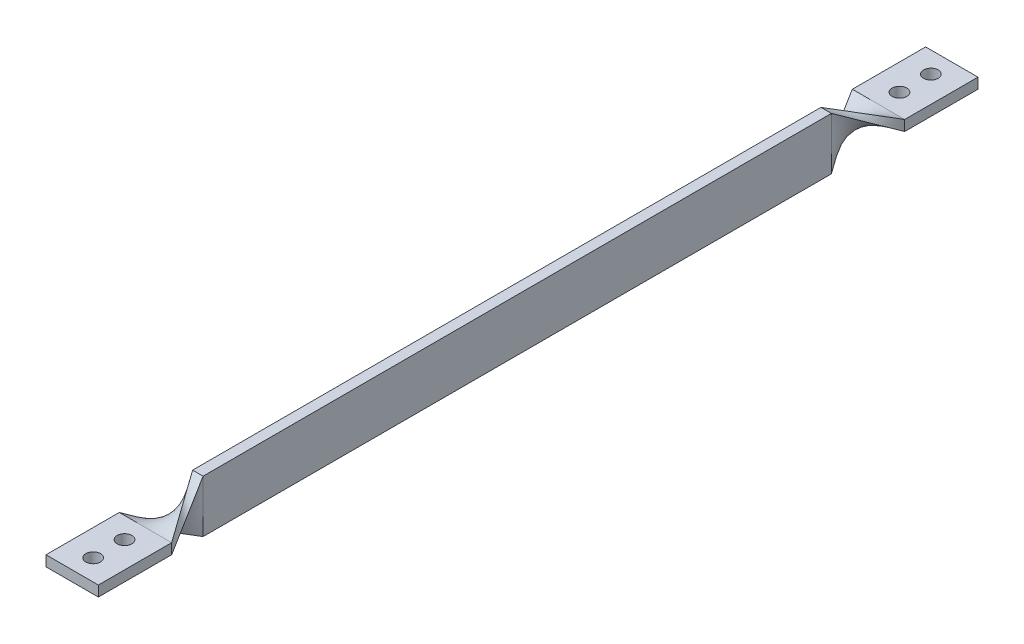
ISO-10303-21;
HEADER;
FILE_DESCRIPTION(('STEP AP214'),'2;1');
FILE_NAME('part.step','',(''),(''),'','','');
FILE_SCHEMA(('AUTOMOTIVE_DESIGN { 1 0 10303 214 1 1 1 1 }'));
ENDSEC;
DATA;
#1=APPLICATION_CONTEXT('core data for automotive mechanical design processes');
#2=APPLICATION_PROTOCOL_DEFINITION('international standard','automotive_design',2000,#1);
#3=PRODUCT_CONTEXT('',#1,'mechanical');
#4=PRODUCT('Part','Part','',(#3));
#5=PRODUCT_RELATED_PRODUCT_CATEGORY('part','',(#4));
#6=PRODUCT_DEFINITION_FORMATION('','',#4);
#7=PRODUCT_DEFINITION_CONTEXT('part definition',#1,'design');
#8=PRODUCT_DEFINITION('design','',#6,#7);
#9=PRODUCT_DEFINITION_SHAPE('','',#8);
#10=(LENGTH_UNIT() NAMED_UNIT(*) SI_UNIT(.MILLI.,.METRE.));
#11=(NAMED_UNIT(*) PLANE_ANGLE_UNIT() SI_UNIT($,.RADIAN.));
#12=(NAMED_UNIT(*) SI_UNIT($,.STERADIAN.) SOLID_ANGLE_UNIT());
#13=UNCERTAINTY_MEASURE_WITH_UNIT(LENGTH_MEASURE(1.E-05),#10,'distance_accuracy_value','');
#14=(GEOMETRIC_REPRESENTATION_CONTEXT(3) GLOBAL_UNCERTAINTY_ASSIGNED_CONTEXT((#13)) GLOBAL_UNIT_ASSIGNED_CONTEXT((#10,
#11,#12)) REPRESENTATION_CONTEXT('',''));
#15=CARTESIAN_POINT('',(0.,0.,0.));
#16=DIRECTION('',(0.,0.,1.));
#17=DIRECTION('',(1.,0.,0.));
#18=AXIS2_PLACEMENT_3D('',#15,#16,#17);
#19=CARTESIAN_POINT('',(0.,0.,17.5));
#20=DIRECTION('',(1.,0.,0.));
#21=DIRECTION('',(0.,0.,-1.));
#22=AXIS2_PLACEMENT_3D('',#19,#20,#21);
#23=PLANE('',#22);
#24=DIRECTION('',(0.,-1.,0.));
#25=VECTOR('',#24,1.);
#26=CARTESIAN_POINT('',(0.,0.,-17.5));
#27=LINE('',#26,#25);
#28=CARTESIAN_POINT('',(0.,5.,-17.5));
#29=VERTEX_POINT('',#28);
#30=CARTESIAN_POINT('',(0.,0.,-17.5));
#31=VERTEX_POINT('',#30);
#32=EDGE_CURVE('E154',#29,#31,#27,.T.);
#33=ORIENTED_EDGE('',*,*,#32,.T.);
#34=DIRECTION('',(0.,0.,-1.));
#35=VECTOR('',#34,1.);
#36=CARTESIAN_POINT('',(0.,0.,17.5));
#37=LINE('',#36,#35);
#38=CARTESIAN_POINT('',(0.,0.,17.5));
#39=VERTEX_POINT('',#38);
#40=EDGE_CURVE('E12',#39,#31,#37,.T.);
#41=ORIENTED_EDGE('',*,*,#40,.F.);
#42=DIRECTION('',(0.,1.,0.));
#43=VECTOR('',#42,1.);
#44=CARTESIAN_POINT('',(0.,0.,17.5));
#45=LINE('',#44,#43);
#46=CARTESIAN_POINT('',(0.,5.,17.5));
#47=VERTEX_POINT('',#46);
#48=EDGE_CURVE('E147',#47,#39,#45,.F.);
#49=ORIENTED_EDGE('',*,*,#48,.F.);
#50=DIRECTION('',(0.,0.,-1.));
#51=VECTOR('',#50,1.);
#52=CARTESIAN_POINT('',(0.,5.,17.5));
#53=LINE('',#52,#51);
#54=EDGE_CURVE('E141',#47,#29,#53,.T.);
#55=ORIENTED_EDGE('',*,*,#54,.T.);
#56=EDGE_LOOP('',(#33,#41,#49,#55));
#57=FACE_BOUND('',#56,.T.);
#58=ADVANCED_FACE('F61',(#57),#23,.F.);
#59=CARTESIAN_POINT('',(0.,0.,17.5));
#60=DIRECTION('',(0.,1.,0.));
#61=DIRECTION('',(0.,0.,1.));
#62=AXIS2_PLACEMENT_3D('',#59,#60,#61);
#63=PLANE('',#62);
#64=CARTESIAN_POINT('',(12.5,0.,-7.49999999999999));
#65=DIRECTION('',(0.,1.,0.));
#66=DIRECTION('',(0.,0.,1.));
#67=AXIS2_PLACEMENT_3D('',#64,#65,#66);
#68=CIRCLE('',#67,3.5);
#69=CARTESIAN_POINT('',(12.5,0.,-3.99999999999999));
#70=VERTEX_POINT('',#69);
#71=EDGE_CURVE('E419',#70,#70,#68,.T.);
#72=ORIENTED_EDGE('',*,*,#71,.T.);
#73=EDGE_LOOP('',(#72));
#74=FACE_BOUND('',#73,.T.);
#75=CARTESIAN_POINT('',(12.5,0.,7.50000000000001));
#76=DIRECTION('',(0.,1.,0.));
#77=DIRECTION('',(0.,0.,1.));
#78=AXIS2_PLACEMENT_3D('',#75,#76,#77);
#79=CIRCLE('',#78,3.5);
#80=CARTESIAN_POINT('',(12.5,0.,11.));
#81=VERTEX_POINT('',#80);
#82=EDGE_CURVE('E423',#81,#81,#79,.T.);
#83=ORIENTED_EDGE('',*,*,#82,.T.);
#84=EDGE_LOOP('',(#83));
#85=FACE_BOUND('',#84,.T.);
#86=DIRECTION('',(1.,0.,0.));
#87=VECTOR('',#86,1.);
#88=CARTESIAN_POINT('',(0.,0.,-17.5));
#89=LINE('',#88,#87);
#90=CARTESIAN_POINT('',(25.,0.,-17.5));
#91=VERTEX_POINT('',#90);
#92=EDGE_CURVE('E160',#31,#91,#89,.T.);
#93=ORIENTED_EDGE('',*,*,#92,.T.);
#94=DIRECTION('',(0.,0.,-1.));
#95=VECTOR('',#94,1.);
#96=CARTESIAN_POINT('',(25.,0.,17.5));
#97=LINE('',#96,#95);
#98=CARTESIAN_POINT('',(25.,0.,17.5));
#99=VERTEX_POINT('',#98);
#100=EDGE_CURVE('E72',#99,#91,#97,.T.);
#101=ORIENTED_EDGE('',*,*,#100,.F.);
#102=DIRECTION('',(1.,0.,0.));
#103=VECTOR('',#102,1.);
#104=CARTESIAN_POINT('',(0.,0.,17.5));
#105=LINE('',#104,#103);
#106=EDGE_CURVE('E183',#39,#99,#105,.T.);
#107=ORIENTED_EDGE('',*,*,#106,.F.);
#108=ORIENTED_EDGE('',*,*,#40,.T.);
#109=EDGE_LOOP('',(#93,#101,#107,#108));
#110=FACE_BOUND('',#109,.T.);
#111=ADVANCED_FACE('F409',(#74,#85,#110),#63,.F.);
#112=CARTESIAN_POINT('',(25.,0.,17.5));
#113=DIRECTION('',(-1.,0.,0.));
#114=DIRECTION('',(0.,0.,1.));
#115=AXIS2_PLACEMENT_3D('',#112,#113,#114);
#116=PLANE('',#115);
#117=DIRECTION('',(0.,1.,0.));
#118=VECTOR('',#117,1.);
#119=CARTESIAN_POINT('',(25.,0.,-17.5));
#120=LINE('',#119,#118);
#121=CARTESIAN_POINT('',(25.,5.,-17.5));
#122=VERTEX_POINT('',#121);
#123=EDGE_CURVE('E148',#91,#122,#120,.T.);
#124=ORIENTED_EDGE('',*,*,#123,.T.);
#125=DIRECTION('',(0.,0.,-1.));
#126=VECTOR('',#125,1.);
#127=CARTESIAN_POINT('',(25.,5.,17.5));
#128=LINE('',#127,#126);
#129=CARTESIAN_POINT('',(25.,5.,17.5));
#130=VERTEX_POINT('',#129);
#131=EDGE_CURVE('E81',#130,#122,#128,.T.);
#132=ORIENTED_EDGE('',*,*,#131,.F.);
#133=DIRECTION('',(0.,1.,0.));
#134=VECTOR('',#133,1.);
#135=CARTESIAN_POINT('',(25.,0.,17.5));
#136=LINE('',#135,#134);
#137=EDGE_CURVE('E187',#99,#130,#136,.T.);
#138=ORIENTED_EDGE('',*,*,#137,.F.);
#139=ORIENTED_EDGE('',*,*,#100,.T.);
#140=EDGE_LOOP('',(#124,#132,#138,#139));
#141=FACE_BOUND('',#140,.T.);
#142=ADVANCED_FACE('F406',(#141),#116,.F.);
#143=CARTESIAN_POINT('',(0.,5.,17.5));
#144=DIRECTION('',(0.,-1.,0.));
#145=DIRECTION('',(1.,0.,0.));
#146=AXIS2_PLACEMENT_3D('',#143,#144,#145);
#147=PLANE('',#146);
#148=CARTESIAN_POINT('',(12.5,5.,-7.49999999999999));
#149=DIRECTION('',(0.,1.,0.));
#150=DIRECTION('',(-1.,0.,0.));
#151=AXIS2_PLACEMENT_3D('',#148,#149,#150);
#152=CIRCLE('',#151,3.5);
#153=CARTESIAN_POINT('',(9.00000000000001,5.,-7.49999999999999));
#154=VERTEX_POINT('',#153);
#155=EDGE_CURVE('E654',#154,#154,#152,.T.);
#156=ORIENTED_EDGE('',*,*,#155,.F.);
#157=EDGE_LOOP('',(#156));
#158=FACE_BOUND('',#157,.T.);
#159=CARTESIAN_POINT('',(12.5,5.,7.50000000000001));
#160=DIRECTION('',(0.,1.,0.));
#161=DIRECTION('',(-1.,0.,0.));
#162=AXIS2_PLACEMENT_3D('',#159,#160,#161);
#163=CIRCLE('',#162,3.5);
#164=CARTESIAN_POINT('',(9.00000000000001,5.,7.50000000000001));
#165=VERTEX_POINT('',#164);
#166=EDGE_CURVE('E650',#165,#165,#163,.T.);
#167=ORIENTED_EDGE('',*,*,#166,.F.);
#168=EDGE_LOOP('',(#167));
#169=FACE_BOUND('',#168,.T.);
#170=DIRECTION('',(-1.,0.,0.));
#171=VECTOR('',#170,1.);
#172=CARTESIAN_POINT('',(0.,5.,-17.5));
#173=LINE('',#172,#171);
#174=EDGE_CURVE('E138',#122,#29,#173,.T.);
#175=ORIENTED_EDGE('',*,*,#174,.T.);
#176=ORIENTED_EDGE('',*,*,#54,.F.);
#177=DIRECTION('',(1.,0.,0.));
#178=VECTOR('',#177,1.);
#179=CARTESIAN_POINT('',(0.,5.,17.5));
#180=LINE('',#179,#178);
#181=EDGE_CURVE('E157',#130,#47,#180,.F.);
#182=ORIENTED_EDGE('',*,*,#181,.F.);
#183=ORIENTED_EDGE('',*,*,#131,.T.);
#184=EDGE_LOOP('',(#175,#176,#182,#183));
#185=FACE_BOUND('',#184,.T.);
#186=ADVANCED_FACE('F140',(#158,#169,#185),#147,.F.);
#187=CARTESIAN_POINT('',(0.,0.,-17.5));
#188=DIRECTION('',(0.,0.,-1.));
#189=DIRECTION('',(-1.,0.,0.));
#190=AXIS2_PLACEMENT_3D('',#187,#188,#189);
#191=PLANE('',#190);
#192=ORIENTED_EDGE('',*,*,#32,.F.);
#193=ORIENTED_EDGE('',*,*,#174,.F.);
#194=ORIENTED_EDGE('',*,*,#123,.F.);
#195=ORIENTED_EDGE('',*,*,#92,.F.);
#196=EDGE_LOOP('',(#192,#193,#194,#195));
#197=FACE_BOUND('',#196,.T.);
#198=ADVANCED_FACE('F159',(#197),#191,.T.);
#199=CARTESIAN_POINT('',(25.,0.,17.5));
#200=CARTESIAN_POINT('',(15.,15.,42.5));
#201=CARTESIAN_POINT('',(25.,0.833333333333335,17.5));
#202=CARTESIAN_POINT('',(14.1666666666667,15.,42.5));
#203=CARTESIAN_POINT('',(25.,1.66666666666667,17.5));
#204=CARTESIAN_POINT('',(13.3333333333333,15.,42.5));
#205=CARTESIAN_POINT('',(25.,3.33333333333334,17.5));
#206=CARTESIAN_POINT('',(11.6666666666667,15.,42.5));
#207=CARTESIAN_POINT('',(25.,4.16666666666667,17.5));
#208=CARTESIAN_POINT('',(10.8333333333333,15.,42.5));
#209=CARTESIAN_POINT('',(25.,5.,17.5));
#210=CARTESIAN_POINT('',(9.99999999999999,15.,42.5));
#211=B_SPLINE_SURFACE_WITH_KNOTS('',3,1,((#199,#200),(#201,#202),(#203,#204),(#205,#206),(#207,
#208),(#209,#210)),.UNSPECIFIED.,.F.,.F.,.F.,(4,2,4),(2,2),(0.,0.5,1.),(0.,1.),.UNSPECIFIED.);
#212=DIRECTION('',(-0.486664263392288,0.324442842261525,0.811107105653812));
#213=VECTOR('',#212,1.);
#214=CARTESIAN_POINT('',(17.5,10.,30.));
#215=LINE('',#214,#213);
#216=CARTESIAN_POINT('',(9.99999999999999,15.,42.5));
#217=VERTEX_POINT('',#216);
#218=EDGE_CURVE('E114',#130,#217,#215,.T.);
#219=DIRECTION('',(-1.,0.,0.));
#220=VECTOR('',#219,1.);
#221=CARTESIAN_POINT('',(9.99999999999999,15.,42.5));
#222=LINE('',#221,#220);
#223=CARTESIAN_POINT('',(15.,15.,42.5));
#224=VERTEX_POINT('',#223);
#225=EDGE_CURVE('E206',#224,#217,#222,.T.);
#226=DIRECTION('',(0.324442842261525,-0.486664263392288,-0.811107105653812));
#227=VECTOR('',#226,1.);
#228=CARTESIAN_POINT('',(20.,7.5,30.));
#229=LINE('',#228,#227);
#230=EDGE_CURVE('E352',#224,#99,#229,.T.);
#231=ORIENTED_EDGE('',*,*,#137,.T.);
#232=ORIENTED_EDGE('',*,*,#218,.T.);
#233=ORIENTED_EDGE('',*,*,#225,.F.);
#234=ORIENTED_EDGE('',*,*,#230,.T.);
#235=EDGE_LOOP('',(#231,#232,#233,#234));
#236=FACE_BOUND('',#235,.T.);
#237=ADVANCED_FACE('F403',(#236),#211,.T.);
#238=CARTESIAN_POINT('',(25.,5.,17.5));
#239=CARTESIAN_POINT('',(9.99999999999999,15.,42.5));
#240=CARTESIAN_POINT('',(20.8333333333334,5.,17.5));
#241=CARTESIAN_POINT('',(9.99999999999999,10.8333333333333,42.5));
#242=CARTESIAN_POINT('',(16.6666666666667,5.,17.5));
#243=CARTESIAN_POINT('',(10.,6.66666666666667,42.5));
#244=CARTESIAN_POINT('',(8.33333333333337,5.,17.5));
#245=CARTESIAN_POINT('',(10.,-1.66666666666666,42.5));
#246=CARTESIAN_POINT('',(4.16666666666669,5.,17.5));
#247=CARTESIAN_POINT('',(10.,-5.83333333333333,42.5));
#248=CARTESIAN_POINT('',(0.,5.,17.5));
#249=CARTESIAN_POINT('',(10.,-10.,42.5));
#250=B_SPLINE_SURFACE_WITH_KNOTS('',3,1,((#238,#239),(#240,#241),(#242,#243),(#244,#245),(#246,
#247),(#248,#249)),.UNSPECIFIED.,.F.,.F.,.F.,(4,2,4),(2,2),(0.,0.5,1.),(0.,1.),.UNSPECIFIED.);
#251=DIRECTION('',(0.324442842261525,-0.486664263392288,0.811107105653813));
#252=VECTOR('',#251,1.);
#253=CARTESIAN_POINT('',(5.,-2.5,30.));
#254=LINE('',#253,#252);
#255=CARTESIAN_POINT('',(10.,-10.,42.5));
#256=VERTEX_POINT('',#255);
#257=EDGE_CURVE('E351',#47,#256,#254,.T.);
#258=DIRECTION('',(0.,-1.,0.));
#259=VECTOR('',#258,1.);
#260=CARTESIAN_POINT('',(9.99999999999999,15.,42.5));
#261=LINE('',#260,#259);
#262=EDGE_CURVE('E259',#217,#256,#261,.T.);
#263=ORIENTED_EDGE('',*,*,#181,.T.);
#264=ORIENTED_EDGE('',*,*,#257,.T.);
#265=ORIENTED_EDGE('',*,*,#262,.F.);
#266=ORIENTED_EDGE('',*,*,#218,.F.);
#267=EDGE_LOOP('',(#263,#264,#265,#266));
#268=FACE_BOUND('',#267,.T.);
#269=ADVANCED_FACE('F445',(#268),#250,.T.);
#270=CARTESIAN_POINT('',(0.,0.,17.5));
#271=CARTESIAN_POINT('',(15.,-10.,42.5));
#272=CARTESIAN_POINT('',(4.16666666666666,0.,17.5));
#273=CARTESIAN_POINT('',(15.,-5.83333333333333,42.5));
#274=CARTESIAN_POINT('',(8.33333333333333,0.,17.5));
#275=CARTESIAN_POINT('',(15.,-1.66666666666665,42.5));
#276=CARTESIAN_POINT('',(16.6666666666667,0.,17.5));
#277=CARTESIAN_POINT('',(15.,6.66666666666668,42.5));
#278=CARTESIAN_POINT('',(20.8333333333333,0.,17.5));
#279=CARTESIAN_POINT('',(15.,10.8333333333333,42.5));
#280=CARTESIAN_POINT('',(25.,0.,17.5));
#281=CARTESIAN_POINT('',(15.,15.,42.5));
#282=B_SPLINE_SURFACE_WITH_KNOTS('',3,1,((#270,#271),(#272,#273),(#274,#275),(#276,#277),(#278,
#279),(#280,#281)),.UNSPECIFIED.,.F.,.F.,.F.,(4,2,4),(2,2),(0.,0.5,1.),(0.,1.),.UNSPECIFIED.);
#283=DIRECTION('',(0.,1.,0.));
#284=VECTOR('',#283,1.);
#285=CARTESIAN_POINT('',(15.,15.,42.5));
#286=LINE('',#285,#284);
#287=CARTESIAN_POINT('',(15.,-10.,42.5));
#288=VERTEX_POINT('',#287);
#289=EDGE_CURVE('E168',#288,#224,#286,.T.);
#290=DIRECTION('',(0.486664263392288,-0.324442842261525,0.811107105653813));
#291=VECTOR('',#290,1.);
#292=CARTESIAN_POINT('',(7.5,-5.,30.));
#293=LINE('',#292,#291);
#294=EDGE_CURVE('E264',#39,#288,#293,.T.);
#295=ORIENTED_EDGE('',*,*,#106,.T.);
#296=ORIENTED_EDGE('',*,*,#230,.F.);
#297=ORIENTED_EDGE('',*,*,#289,.F.);
#298=ORIENTED_EDGE('',*,*,#294,.F.);
#299=EDGE_LOOP('',(#295,#296,#297,#298));
#300=FACE_BOUND('',#299,.T.);
#301=ADVANCED_FACE('F391',(#300),#282,.T.);
#302=CARTESIAN_POINT('',(0.,5.,17.5));
#303=CARTESIAN_POINT('',(10.,-10.,42.5));
#304=CARTESIAN_POINT('',(0.,4.16666666666667,17.5));
#305=CARTESIAN_POINT('',(10.8333333333333,-10.,42.5));
#306=CARTESIAN_POINT('',(0.,3.33333333333334,17.5));
#307=CARTESIAN_POINT('',(11.6666666666667,-10.,42.5));
#308=CARTESIAN_POINT('',(0.,1.66666666666667,17.5));
#309=CARTESIAN_POINT('',(13.3333333333333,-10.,42.5));
#310=CARTESIAN_POINT('',(0.,0.833333333333337,17.5));
#311=CARTESIAN_POINT('',(14.1666666666667,-10.,42.5));
#312=CARTESIAN_POINT('',(0.,0.,17.5));
#313=CARTESIAN_POINT('',(15.,-10.,42.5));
#314=B_SPLINE_SURFACE_WITH_KNOTS('',3,1,((#302,#303),(#304,#305),(#306,#307),(#308,#309),(#310,
#311),(#312,#313)),.UNSPECIFIED.,.F.,.F.,.F.,(4,2,4),(2,2),(0.,0.5,1.),(0.,1.),.UNSPECIFIED.);
#315=DIRECTION('',(1.,0.,0.));
#316=VECTOR('',#315,1.);
#317=CARTESIAN_POINT('',(10.,-10.,42.5));
#318=LINE('',#317,#316);
#319=EDGE_CURVE('E162',#256,#288,#318,.T.);
#320=ORIENTED_EDGE('',*,*,#48,.T.);
#321=ORIENTED_EDGE('',*,*,#294,.T.);
#322=ORIENTED_EDGE('',*,*,#319,.F.);
#323=ORIENTED_EDGE('',*,*,#257,.F.);
#324=EDGE_LOOP('',(#320,#321,#322,#323));
#325=FACE_BOUND('',#324,.T.);
#326=ADVANCED_FACE('F378',(#325),#314,.T.);
#327=CARTESIAN_POINT('',(9.99999999999999,15.,342.5));
#328=DIRECTION('',(1.,0.,0.));
#329=DIRECTION('',(0.,1.,0.));
#330=AXIS2_PLACEMENT_3D('',#327,#328,#329);
#331=PLANE('',#330);
#332=ORIENTED_EDGE('',*,*,#262,.T.);
#333=DIRECTION('',(0.,0.,-1.));
#334=VECTOR('',#333,1.);
#335=CARTESIAN_POINT('',(10.,-10.,342.5));
#336=LINE('',#335,#334);
#337=CARTESIAN_POINT('',(10.,-10.,342.5));
#338=VERTEX_POINT('',#337);
#339=EDGE_CURVE('E367',#338,#256,#336,.T.);
#340=ORIENTED_EDGE('',*,*,#339,.F.);
#341=DIRECTION('',(0.,1.,0.));
#342=VECTOR('',#341,1.);
#343=CARTESIAN_POINT('',(9.99999999999999,15.,342.5));
#344=LINE('',#343,#342);
#345=CARTESIAN_POINT('',(9.99999999999999,15.,342.5));
#346=VERTEX_POINT('',#345);
#347=EDGE_CURVE('E268',#346,#338,#344,.F.);
#348=ORIENTED_EDGE('',*,*,#347,.F.);
#349=DIRECTION('',(0.,0.,-1.));
#350=VECTOR('',#349,1.);
#351=CARTESIAN_POINT('',(9.99999999999999,15.,342.5));
#352=LINE('',#351,#350);
#353=EDGE_CURVE('E193',#346,#217,#352,.T.);
#354=ORIENTED_EDGE('',*,*,#353,.T.);
#355=EDGE_LOOP('',(#332,#340,#348,#354));
#356=FACE_BOUND('',#355,.T.);
#357=ADVANCED_FACE('F390',(#356),#331,.F.);
#358=CARTESIAN_POINT('',(10.,-10.,342.5));
#359=DIRECTION('',(0.,1.,0.));
#360=DIRECTION('',(0.,0.,1.));
#361=AXIS2_PLACEMENT_3D('',#358,#359,#360);
#362=PLANE('',#361);
#363=ORIENTED_EDGE('',*,*,#319,.T.);
#364=DIRECTION('',(0.,0.,-1.));
#365=VECTOR('',#364,1.);
#366=CARTESIAN_POINT('',(15.,-10.,342.5));
#367=LINE('',#366,#365);
#368=CARTESIAN_POINT('',(15.,-10.,342.5));
#369=VERTEX_POINT('',#368);
#370=EDGE_CURVE('E250',#369,#288,#367,.T.);
#371=ORIENTED_EDGE('',*,*,#370,.F.);
#372=DIRECTION('',(1.,0.,0.));
#373=VECTOR('',#372,1.);
#374=CARTESIAN_POINT('',(10.,-10.,342.5));
#375=LINE('',#374,#373);
#376=EDGE_CURVE('E106',#338,#369,#375,.T.);
#377=ORIENTED_EDGE('',*,*,#376,.F.);
#378=ORIENTED_EDGE('',*,*,#339,.T.);
#379=EDGE_LOOP('',(#363,#371,#377,#378));
#380=FACE_BOUND('',#379,.T.);
#381=ADVANCED_FACE('F232',(#380),#362,.F.);
#382=CARTESIAN_POINT('',(15.,15.,342.5));
#383=DIRECTION('',(-1.,0.,0.));
#384=DIRECTION('',(0.,-1.,0.));
#385=AXIS2_PLACEMENT_3D('',#382,#383,#384);
#386=PLANE('',#385);
#387=ORIENTED_EDGE('',*,*,#289,.T.);
#388=DIRECTION('',(0.,0.,-1.));
#389=VECTOR('',#388,1.);
#390=CARTESIAN_POINT('',(15.,15.,342.5));
#391=LINE('',#390,#389);
#392=CARTESIAN_POINT('',(15.,15.,342.5));
#393=VERTEX_POINT('',#392);
#394=EDGE_CURVE('E197',#393,#224,#391,.T.);
#395=ORIENTED_EDGE('',*,*,#394,.F.);
#396=DIRECTION('',(0.,-1.,0.));
#397=VECTOR('',#396,1.);
#398=CARTESIAN_POINT('',(15.,15.,342.5));
#399=LINE('',#398,#397);
#400=EDGE_CURVE('E276',#369,#393,#399,.F.);
#401=ORIENTED_EDGE('',*,*,#400,.F.);
#402=ORIENTED_EDGE('',*,*,#370,.T.);
#403=EDGE_LOOP('',(#387,#395,#401,#402));
#404=FACE_BOUND('',#403,.T.);
#405=ADVANCED_FACE('F223',(#404),#386,.F.);
#406=CARTESIAN_POINT('',(9.99999999999999,15.,342.5));
#407=DIRECTION('',(0.,-1.,0.));
#408=DIRECTION('',(0.,0.,-1.));
#409=AXIS2_PLACEMENT_3D('',#406,#407,#408);
#410=PLANE('',#409);
#411=ORIENTED_EDGE('',*,*,#225,.T.);
#412=ORIENTED_EDGE('',*,*,#353,.F.);
#413=DIRECTION('',(1.,0.,0.));
#414=VECTOR('',#413,1.);
#415=CARTESIAN_POINT('',(9.99999999999999,15.,342.5));
#416=LINE('',#415,#414);
#417=EDGE_CURVE('E198',#393,#346,#416,.F.);
#418=ORIENTED_EDGE('',*,*,#417,.F.);
#419=ORIENTED_EDGE('',*,*,#394,.T.);
#420=EDGE_LOOP('',(#411,#412,#418,#419));
#421=FACE_BOUND('',#420,.T.);
#422=ADVANCED_FACE('F212',(#421),#410,.F.);
#423=CARTESIAN_POINT('',(25.,0.,367.5));
#424=CARTESIAN_POINT('',(15.,15.,342.5));
#425=CARTESIAN_POINT('',(20.8333333333333,0.,367.5));
#426=CARTESIAN_POINT('',(15.,10.8333333333333,342.5));
#427=CARTESIAN_POINT('',(16.6666666666667,0.,367.5));
#428=CARTESIAN_POINT('',(15.,6.66666666666664,342.5));
#429=CARTESIAN_POINT('',(8.33333333333335,0.,367.5));
#430=CARTESIAN_POINT('',(15.,-1.66666666666669,342.5));
#431=CARTESIAN_POINT('',(4.16666666666668,0.,367.5));
#432=CARTESIAN_POINT('',(15.,-5.83333333333335,342.5));
#433=CARTESIAN_POINT('',(0.,0.,367.5));
#434=CARTESIAN_POINT('',(15.,-10.,342.5));
#435=B_SPLINE_SURFACE_WITH_KNOTS('',3,1,((#423,#424),(#425,#426),(#427,#428),(#429,#430),(#431,
#432),(#433,#434)),.UNSPECIFIED.,.F.,.F.,.F.,(4,2,4),(2,2),(0.,0.5,1.),(0.,1.),.UNSPECIFIED.);
#436=DIRECTION('',(1.,0.,0.));
#437=VECTOR('',#436,1.);
#438=CARTESIAN_POINT('',(0.,0.,367.5));
#439=LINE('',#438,#437);
#440=CARTESIAN_POINT('',(0.,0.,367.5));
#441=VERTEX_POINT('',#440);
#442=CARTESIAN_POINT('',(25.,0.,367.5));
#443=VERTEX_POINT('',#442);
#444=EDGE_CURVE('E341',#441,#443,#439,.T.);
#445=DIRECTION('',(0.486664263392287,-0.324442842261525,-0.811107105653813));
#446=VECTOR('',#445,1.);
#447=CARTESIAN_POINT('',(7.5,-5.,355.));
#448=LINE('',#447,#446);
#449=EDGE_CURVE('E505',#441,#369,#448,.T.);
#450=DIRECTION('',(0.324442842261525,-0.486664263392287,0.811107105653813));
#451=VECTOR('',#450,1.);
#452=CARTESIAN_POINT('',(20.,7.5,355.));
#453=LINE('',#452,#451);
#454=EDGE_CURVE('E502',#393,#443,#453,.T.);
#455=ORIENTED_EDGE('',*,*,#444,.F.);
#456=ORIENTED_EDGE('',*,*,#449,.T.);
#457=ORIENTED_EDGE('',*,*,#400,.T.);
#458=ORIENTED_EDGE('',*,*,#454,.T.);
#459=EDGE_LOOP('',(#455,#456,#457,#458));
#460=FACE_BOUND('',#459,.T.);
#461=ADVANCED_FACE('F222',(#460),#435,.T.);
#462=CARTESIAN_POINT('',(0.,0.,367.5));
#463=CARTESIAN_POINT('',(15.,-10.,342.5));
#464=CARTESIAN_POINT('',(0.,0.833333333333333,367.5));
#465=CARTESIAN_POINT('',(14.1666666666667,-10.,342.5));
#466=CARTESIAN_POINT('',(0.,1.66666666666666,367.5));
#467=CARTESIAN_POINT('',(13.3333333333333,-10.,342.5));
#468=CARTESIAN_POINT('',(0.,3.33333333333333,367.5));
#469=CARTESIAN_POINT('',(11.6666666666667,-10.,342.5));
#470=CARTESIAN_POINT('',(0.,4.16666666666666,367.5));
#471=CARTESIAN_POINT('',(10.8333333333333,-10.,342.5));
#472=CARTESIAN_POINT('',(0.,5.,367.5));
#473=CARTESIAN_POINT('',(10.,-10.,342.5));
#474=B_SPLINE_SURFACE_WITH_KNOTS('',3,1,((#462,#463),(#464,#465),(#466,#467),(#468,#469),(#470,
#471),(#472,#473)),.UNSPECIFIED.,.F.,.F.,.F.,(4,2,4),(2,2),(0.,0.5,1.),(0.,1.),.UNSPECIFIED.);
#475=DIRECTION('',(0.,-1.,0.));
#476=VECTOR('',#475,1.);
#477=CARTESIAN_POINT('',(0.,5.,367.5));
#478=LINE('',#477,#476);
#479=CARTESIAN_POINT('',(0.,5.,367.5));
#480=VERTEX_POINT('',#479);
#481=EDGE_CURVE('E64',#480,#441,#478,.T.);
#482=DIRECTION('',(0.324442842261525,-0.486664263392287,-0.811107105653813));
#483=VECTOR('',#482,1.);
#484=CARTESIAN_POINT('',(5.,-2.5,355.));
#485=LINE('',#484,#483);
#486=EDGE_CURVE('E513',#480,#338,#485,.T.);
#487=ORIENTED_EDGE('',*,*,#481,.F.);
#488=ORIENTED_EDGE('',*,*,#486,.T.);
#489=ORIENTED_EDGE('',*,*,#376,.T.);
#490=ORIENTED_EDGE('',*,*,#449,.F.);
#491=EDGE_LOOP('',(#487,#488,#489,#490));
#492=FACE_BOUND('',#491,.T.);
#493=ADVANCED_FACE('F536',(#492),#474,.T.);
#494=CARTESIAN_POINT('',(25.,5.,367.5));
#495=CARTESIAN_POINT('',(9.99999999999999,15.,342.5));
#496=CARTESIAN_POINT('',(25.,4.16666666666667,367.5));
#497=CARTESIAN_POINT('',(10.8333333333333,15.,342.5));
#498=CARTESIAN_POINT('',(25.,3.33333333333334,367.5));
#499=CARTESIAN_POINT('',(11.6666666666667,15.,342.5));
#500=CARTESIAN_POINT('',(25.,1.66666666666667,367.5));
#501=CARTESIAN_POINT('',(13.3333333333333,15.,342.5));
#502=CARTESIAN_POINT('',(25.,0.833333333333337,367.5));
#503=CARTESIAN_POINT('',(14.1666666666667,15.,342.5));
#504=CARTESIAN_POINT('',(25.,0.,367.5));
#505=CARTESIAN_POINT('',(15.,15.,342.5));
#506=B_SPLINE_SURFACE_WITH_KNOTS('',3,1,((#494,#495),(#496,#497),(#498,#499),(#500,#501),(#502,
#503),(#504,#505)),.UNSPECIFIED.,.F.,.F.,.F.,(4,2,4),(2,2),(0.,0.5,1.),(0.,1.),.UNSPECIFIED.);
#507=DIRECTION('',(0.,1.,0.));
#508=VECTOR('',#507,1.);
#509=CARTESIAN_POINT('',(25.,5.,367.5));
#510=LINE('',#509,#508);
#511=CARTESIAN_POINT('',(25.,5.,367.5));
#512=VERTEX_POINT('',#511);
#513=EDGE_CURVE('E332',#443,#512,#510,.T.);
#514=DIRECTION('',(-0.486664263392287,0.324442842261525,-0.811107105653813));
#515=VECTOR('',#514,1.);
#516=CARTESIAN_POINT('',(17.5,10.,355.));
#517=LINE('',#516,#515);
#518=EDGE_CURVE('E272',#512,#346,#517,.T.);
#519=ORIENTED_EDGE('',*,*,#513,.F.);
#520=ORIENTED_EDGE('',*,*,#454,.F.);
#521=ORIENTED_EDGE('',*,*,#417,.T.);
#522=ORIENTED_EDGE('',*,*,#518,.F.);
#523=EDGE_LOOP('',(#519,#520,#521,#522));
#524=FACE_BOUND('',#523,.T.);
#525=ADVANCED_FACE('F507',(#524),#506,.T.);
#526=CARTESIAN_POINT('',(0.,5.,367.5));
#527=CARTESIAN_POINT('',(10.,-10.,342.5));
#528=CARTESIAN_POINT('',(4.16666666666666,5.,367.5));
#529=CARTESIAN_POINT('',(10.,-5.83333333333333,342.5));
#530=CARTESIAN_POINT('',(8.33333333333333,5.,367.5));
#531=CARTESIAN_POINT('',(10.,-1.66666666666666,342.5));
#532=CARTESIAN_POINT('',(16.6666666666667,5.,367.5));
#533=CARTESIAN_POINT('',(10.,6.66666666666668,342.5));
#534=CARTESIAN_POINT('',(20.8333333333333,5.,367.5));
#535=CARTESIAN_POINT('',(9.99999999999999,10.8333333333333,342.5));
#536=CARTESIAN_POINT('',(25.,5.,367.5));
#537=CARTESIAN_POINT('',(9.99999999999999,15.,342.5));
#538=B_SPLINE_SURFACE_WITH_KNOTS('',3,1,((#526,#527),(#528,#529),(#530,#531),(#532,#533),(#534,
#535),(#536,#537)),.UNSPECIFIED.,.F.,.F.,.F.,(4,2,4),(2,2),(0.,0.5,1.),(0.,1.),.UNSPECIFIED.);
#539=DIRECTION('',(-1.,0.,0.));
#540=VECTOR('',#539,1.);
#541=CARTESIAN_POINT('',(0.,5.,367.5));
#542=LINE('',#541,#540);
#543=EDGE_CURVE('E297',#512,#480,#542,.T.);
#544=ORIENTED_EDGE('',*,*,#543,.F.);
#545=ORIENTED_EDGE('',*,*,#518,.T.);
#546=ORIENTED_EDGE('',*,*,#347,.T.);
#547=ORIENTED_EDGE('',*,*,#486,.F.);
#548=EDGE_LOOP('',(#544,#545,#546,#547));
#549=FACE_BOUND('',#548,.T.);
#550=ADVANCED_FACE('F224',(#549),#538,.T.);
#551=CARTESIAN_POINT('',(0.,5.,402.5));
#552=DIRECTION('',(1.,0.,0.));
#553=DIRECTION('',(0.,0.,-1.));
#554=AXIS2_PLACEMENT_3D('',#551,#552,#553);
#555=PLANE('',#554);
#556=ORIENTED_EDGE('',*,*,#481,.T.);
#557=DIRECTION('',(0.,0.,-1.));
#558=VECTOR('',#557,1.);
#559=CARTESIAN_POINT('',(0.,0.,402.5));
#560=LINE('',#559,#558);
#561=CARTESIAN_POINT('',(0.,0.,402.5));
#562=VERTEX_POINT('',#561);
#563=EDGE_CURVE('E578',#562,#441,#560,.T.);
#564=ORIENTED_EDGE('',*,*,#563,.F.);
#565=DIRECTION('',(0.,-1.,0.));
#566=VECTOR('',#565,1.);
#567=CARTESIAN_POINT('',(0.,5.,402.5));
#568=LINE('',#567,#566);
#569=CARTESIAN_POINT('',(0.,5.,402.5));
#570=VERTEX_POINT('',#569);
#571=EDGE_CURVE('E634',#570,#562,#568,.T.);
#572=ORIENTED_EDGE('',*,*,#571,.F.);
#573=DIRECTION('',(0.,0.,-1.));
#574=VECTOR('',#573,1.);
#575=CARTESIAN_POINT('',(0.,5.,402.5));
#576=LINE('',#575,#574);
#577=EDGE_CURVE('E282',#570,#480,#576,.T.);
#578=ORIENTED_EDGE('',*,*,#577,.T.);
#579=EDGE_LOOP('',(#556,#564,#572,#578));
#580=FACE_BOUND('',#579,.T.);
#581=ADVANCED_FACE('F588',(#580),#555,.F.);
#582=CARTESIAN_POINT('',(0.,0.,402.5));
#583=DIRECTION('',(0.,1.,0.));
#584=DIRECTION('',(-1.,0.,0.));
#585=AXIS2_PLACEMENT_3D('',#582,#583,#584);
#586=PLANE('',#585);
#587=CARTESIAN_POINT('',(12.5000000000001,0.,392.5));
#588=DIRECTION('',(0.,1.,0.));
#589=DIRECTION('',(-1.,0.,0.));
#590=AXIS2_PLACEMENT_3D('',#587,#588,#589);
#591=CIRCLE('',#590,3.5);
#592=CARTESIAN_POINT('',(9.00000000000005,0.,392.5));
#593=VERTEX_POINT('',#592);
#594=EDGE_CURVE('E642',#593,#593,#591,.T.);
#595=ORIENTED_EDGE('',*,*,#594,.T.);
#596=EDGE_LOOP('',(#595));
#597=FACE_BOUND('',#596,.T.);
#598=CARTESIAN_POINT('',(12.5,0.,377.5));
#599=DIRECTION('',(0.,1.,0.));
#600=DIRECTION('',(-1.,0.,0.));
#601=AXIS2_PLACEMENT_3D('',#598,#599,#600);
#602=CIRCLE('',#601,3.5);
#603=CARTESIAN_POINT('',(9.00000000000005,0.,377.5));
#604=VERTEX_POINT('',#603);
#605=EDGE_CURVE('E646',#604,#604,#602,.T.);
#606=ORIENTED_EDGE('',*,*,#605,.T.);
#607=EDGE_LOOP('',(#606));
#608=FACE_BOUND('',#607,.T.);
#609=ORIENTED_EDGE('',*,*,#444,.T.);
#610=DIRECTION('',(0.,0.,-1.));
#611=VECTOR('',#610,1.);
#612=CARTESIAN_POINT('',(25.,0.,402.5));
#613=LINE('',#612,#611);
#614=CARTESIAN_POINT('',(25.,0.,402.5));
#615=VERTEX_POINT('',#614);
#616=EDGE_CURVE('E342',#615,#443,#613,.T.);
#617=ORIENTED_EDGE('',*,*,#616,.F.);
#618=DIRECTION('',(1.,0.,0.));
#619=VECTOR('',#618,1.);
#620=CARTESIAN_POINT('',(0.,0.,402.5));
#621=LINE('',#620,#619);
#622=EDGE_CURVE('E630',#562,#615,#621,.T.);
#623=ORIENTED_EDGE('',*,*,#622,.F.);
#624=ORIENTED_EDGE('',*,*,#563,.T.);
#625=EDGE_LOOP('',(#609,#617,#623,#624));
#626=FACE_BOUND('',#625,.T.);
#627=ADVANCED_FACE('F321',(#597,#608,#626),#586,.F.);
#628=CARTESIAN_POINT('',(25.,5.,402.5));
#629=DIRECTION('',(-1.,0.,0.));
#630=DIRECTION('',(0.,0.,1.));
#631=AXIS2_PLACEMENT_3D('',#628,#629,#630);
#632=PLANE('',#631);
#633=ORIENTED_EDGE('',*,*,#513,.T.);
#634=DIRECTION('',(0.,0.,-1.));
#635=VECTOR('',#634,1.);
#636=CARTESIAN_POINT('',(25.,5.,402.5));
#637=LINE('',#636,#635);
#638=CARTESIAN_POINT('',(25.,5.,402.5));
#639=VERTEX_POINT('',#638);
#640=EDGE_CURVE('E286',#639,#512,#637,.T.);
#641=ORIENTED_EDGE('',*,*,#640,.F.);
#642=DIRECTION('',(0.,1.,0.));
#643=VECTOR('',#642,1.);
#644=CARTESIAN_POINT('',(25.,5.,402.5));
#645=LINE('',#644,#643);
#646=EDGE_CURVE('E626',#615,#639,#645,.T.);
#647=ORIENTED_EDGE('',*,*,#646,.F.);
#648=ORIENTED_EDGE('',*,*,#616,.T.);
#649=EDGE_LOOP('',(#633,#641,#647,#648));
#650=FACE_BOUND('',#649,.T.);
#651=ADVANCED_FACE('F315',(#650),#632,.F.);
#652=CARTESIAN_POINT('',(0.,5.,402.5));
#653=DIRECTION('',(0.,-1.,0.));
#654=DIRECTION('',(1.,0.,0.));
#655=AXIS2_PLACEMENT_3D('',#652,#653,#654);
#656=PLANE('',#655);
#657=CARTESIAN_POINT('',(12.5000000000001,5.,392.5));
#658=DIRECTION('',(0.,1.,0.));
#659=DIRECTION('',(-1.,0.,0.));
#660=AXIS2_PLACEMENT_3D('',#657,#658,#659);
#661=CIRCLE('',#660,3.5);
#662=CARTESIAN_POINT('',(9.00000000000005,5.,392.5));
#663=VERTEX_POINT('',#662);
#664=EDGE_CURVE('E658',#663,#663,#661,.T.);
#665=ORIENTED_EDGE('',*,*,#664,.F.);
#666=EDGE_LOOP('',(#665));
#667=FACE_BOUND('',#666,.T.);
#668=CARTESIAN_POINT('',(12.5,5.,377.5));
#669=DIRECTION('',(0.,1.,0.));
#670=DIRECTION('',(-1.,0.,0.));
#671=AXIS2_PLACEMENT_3D('',#668,#669,#670);
#672=CIRCLE('',#671,3.5);
#673=CARTESIAN_POINT('',(9.00000000000005,5.,377.5));
#674=VERTEX_POINT('',#673);
#675=EDGE_CURVE('E662',#674,#674,#672,.T.);
#676=ORIENTED_EDGE('',*,*,#675,.F.);
#677=EDGE_LOOP('',(#676));
#678=FACE_BOUND('',#677,.T.);
#679=ORIENTED_EDGE('',*,*,#543,.T.);
#680=ORIENTED_EDGE('',*,*,#577,.F.);
#681=DIRECTION('',(-1.,0.,0.));
#682=VECTOR('',#681,1.);
#683=CARTESIAN_POINT('',(0.,5.,402.5));
#684=LINE('',#683,#682);
#685=EDGE_CURVE('E287',#639,#570,#684,.T.);
#686=ORIENTED_EDGE('',*,*,#685,.F.);
#687=ORIENTED_EDGE('',*,*,#640,.T.);
#688=EDGE_LOOP('',(#679,#680,#686,#687));
#689=FACE_BOUND('',#688,.T.);
#690=ADVANCED_FACE('F304',(#667,#678,#689),#656,.F.);
#691=CARTESIAN_POINT('',(0.,0.,402.5));
#692=DIRECTION('',(0.,0.,1.));
#693=DIRECTION('',(1.,0.,0.));
#694=AXIS2_PLACEMENT_3D('',#691,#692,#693);
#695=PLANE('',#694);
#696=ORIENTED_EDGE('',*,*,#571,.T.);
#697=ORIENTED_EDGE('',*,*,#622,.T.);
#698=ORIENTED_EDGE('',*,*,#646,.T.);
#699=ORIENTED_EDGE('',*,*,#685,.T.);
#700=EDGE_LOOP('',(#696,#697,#698,#699));
#701=FACE_BOUND('',#700,.T.);
#702=ADVANCED_FACE('F314',(#701),#695,.T.);
#703=CARTESIAN_POINT('',(12.5,-5.,377.5));
#704=DIRECTION('',(0.,1.,0.));
#705=DIRECTION('',(-1.,0.,0.));
#706=AXIS2_PLACEMENT_3D('',#703,#704,#705);
#707=CYLINDRICAL_SURFACE('',#706,3.5);
#708=ORIENTED_EDGE('',*,*,#675,.T.);
#709=EDGE_LOOP('',(#708));
#710=FACE_BOUND('',#709,.T.);
#711=ORIENTED_EDGE('',*,*,#605,.F.);
#712=EDGE_LOOP('',(#711));
#713=FACE_BOUND('',#712,.T.);
#714=ADVANCED_FACE('F679',(#710,#713),#707,.F.);
#715=CARTESIAN_POINT('',(12.5000000000001,-5.,392.5));
#716=DIRECTION('',(0.,1.,0.));
#717=DIRECTION('',(-1.,0.,0.));
#718=AXIS2_PLACEMENT_3D('',#715,#716,#717);
#719=CYLINDRICAL_SURFACE('',#718,3.5);
#720=ORIENTED_EDGE('',*,*,#664,.T.);
#721=EDGE_LOOP('',(#720));
#722=FACE_BOUND('',#721,.T.);
#723=ORIENTED_EDGE('',*,*,#594,.F.);
#724=EDGE_LOOP('',(#723));
#725=FACE_BOUND('',#724,.T.);
#726=ADVANCED_FACE('F683',(#722,#725),#719,.F.);
#727=CARTESIAN_POINT('',(12.5,-5.,7.50000000000001));
#728=DIRECTION('',(0.,1.,0.));
#729=DIRECTION('',(-1.,0.,0.));
#730=AXIS2_PLACEMENT_3D('',#727,#728,#729);
#731=CYLINDRICAL_SURFACE('',#730,3.5);
#732=ORIENTED_EDGE('',*,*,#166,.T.);
#733=EDGE_LOOP('',(#732));
#734=FACE_BOUND('',#733,.T.);
#735=ORIENTED_EDGE('',*,*,#82,.F.);
#736=EDGE_LOOP('',(#735));
#737=FACE_BOUND('',#736,.T.);
#738=ADVANCED_FACE('F688',(#734,#737),#731,.F.);
#739=CARTESIAN_POINT('',(12.5,-5.,-7.49999999999999));
#740=DIRECTION('',(0.,1.,0.));
#741=DIRECTION('',(-1.,0.,0.));
#742=AXIS2_PLACEMENT_3D('',#739,#740,#741);
#743=CYLINDRICAL_SURFACE('',#742,3.5);
#744=ORIENTED_EDGE('',*,*,#155,.T.);
#745=EDGE_LOOP('',(#744));
#746=FACE_BOUND('',#745,.T.);
#747=ORIENTED_EDGE('',*,*,#71,.F.);
#748=EDGE_LOOP('',(#747));
#749=FACE_BOUND('',#748,.T.);
#750=ADVANCED_FACE('F693',(#746,#749),#743,.F.);
#751=CLOSED_SHELL('',(#58,#111,#142,#186,#198,#237,#269,#301,#326,#357,#381,#405,#422,#461,#493,
#525,#550,#581,#627,#651,#690,#702,#714,#726,#738,#750));
#752=MANIFOLD_SOLID_BREP('B2',#751);
#753=ADVANCED_BREP_SHAPE_REPRESENTATION('',(#18,#752),#14);
#754=SHAPE_DEFINITION_REPRESENTATION(#9,#753);
ENDSEC;
END-ISO-10303-21;
